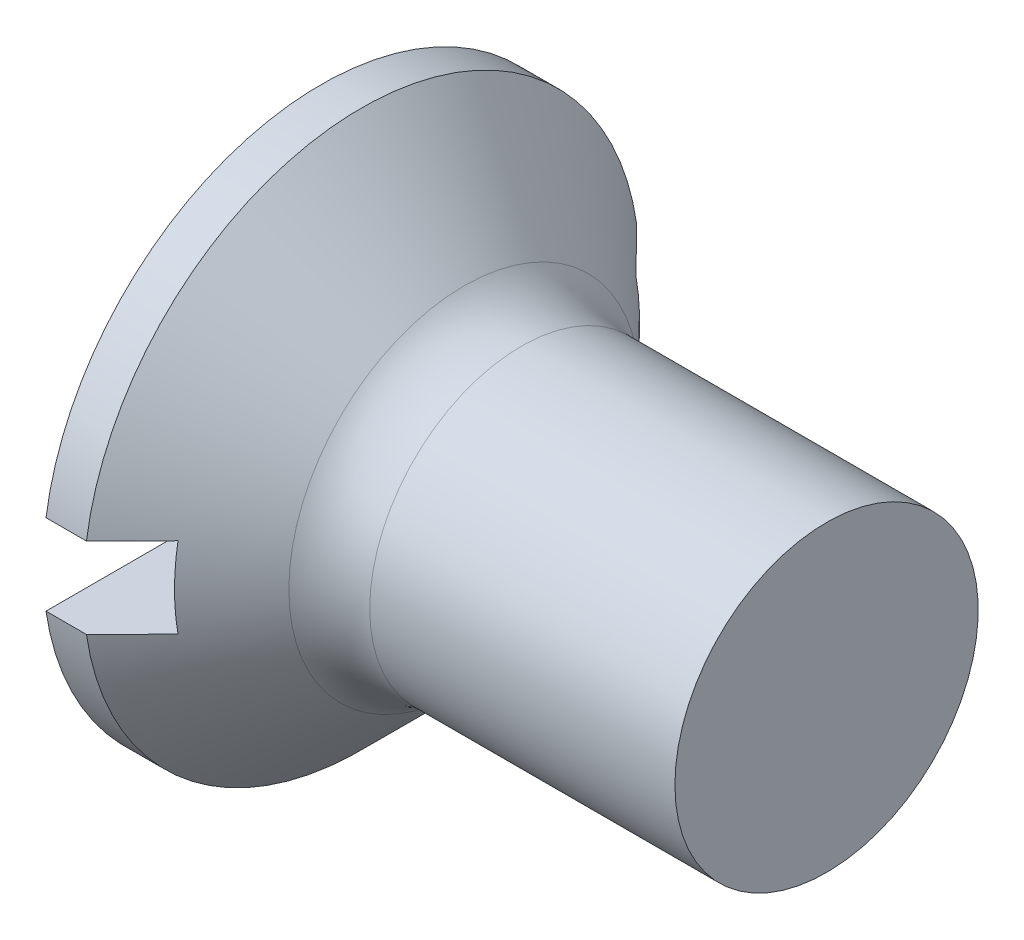
ISO-10303-21;
HEADER;
FILE_DESCRIPTION(('STEP AP214'),'2;1');
FILE_NAME('part.step','',(''),(''),'','','');
FILE_SCHEMA(('AUTOMOTIVE_DESIGN { 1 0 10303 214 1 1 1 1 }'));
ENDSEC;
DATA;
#1=APPLICATION_CONTEXT('core data for automotive mechanical design processes');
#2=APPLICATION_PROTOCOL_DEFINITION('international standard','automotive_design',2000,#1);
#3=PRODUCT_CONTEXT('',#1,'mechanical');
#4=PRODUCT('Part','Part','',(#3));
#5=PRODUCT_RELATED_PRODUCT_CATEGORY('part','',(#4));
#6=PRODUCT_DEFINITION_FORMATION('','',#4);
#7=PRODUCT_DEFINITION_CONTEXT('part definition',#1,'design');
#8=PRODUCT_DEFINITION('design','',#6,#7);
#9=PRODUCT_DEFINITION_SHAPE('','',#8);
#10=(LENGTH_UNIT() NAMED_UNIT(*) SI_UNIT(.MILLI.,.METRE.));
#11=(NAMED_UNIT(*) PLANE_ANGLE_UNIT() SI_UNIT($,.RADIAN.));
#12=(NAMED_UNIT(*) SI_UNIT($,.STERADIAN.) SOLID_ANGLE_UNIT());
#13=UNCERTAINTY_MEASURE_WITH_UNIT(LENGTH_MEASURE(1.E-05),#10,'distance_accuracy_value','');
#14=(GEOMETRIC_REPRESENTATION_CONTEXT(3) GLOBAL_UNCERTAINTY_ASSIGNED_CONTEXT((#13)) GLOBAL_UNIT_ASSIGNED_CONTEXT((#10,
#11,#12)) REPRESENTATION_CONTEXT('',''));
#15=CARTESIAN_POINT('',(0.,0.,0.));
#16=DIRECTION('',(0.,0.,1.));
#17=DIRECTION('',(1.,0.,0.));
#18=AXIS2_PLACEMENT_3D('',#15,#16,#17);
#19=CARTESIAN_POINT('',(0.85,-0.4,-2.75));
#20=DIRECTION('',(1.,0.,0.));
#21=DIRECTION('',(0.,0.,-1.));
#22=AXIS2_PLACEMENT_3D('',#19,#20,#21);
#23=PLANE('',#22);
#24=CARTESIAN_POINT('',(0.850000000014006,0.,0.));
#25=DIRECTION('',(-1.,0.,0.));
#26=DIRECTION('',(0.,0.,1.));
#27=AXIS2_PLACEMENT_3D('',#24,#25,#26);
#28=CIRCLE('',#27,2.30000000001627);
#29=CARTESIAN_POINT('',(0.850000000014577,0.4,2.26495033059717));
#30=VERTEX_POINT('',#29);
#31=CARTESIAN_POINT('',(0.850000000007003,-0.4,2.26495033060486));
#32=VERTEX_POINT('',#31);
#33=EDGE_CURVE('E80',#30,#32,#28,.F.);
#34=ORIENTED_EDGE('',*,*,#33,.F.);
#35=DIRECTION('',(0.,0.,1.));
#36=VECTOR('',#35,1.);
#37=CARTESIAN_POINT('',(0.85,0.4,2.75));
#38=LINE('',#37,#36);
#39=CARTESIAN_POINT('',(0.850000000007003,0.4,-2.26495033060486));
#40=VERTEX_POINT('',#39);
#41=EDGE_CURVE('E82',#30,#40,#38,.F.);
#42=ORIENTED_EDGE('',*,*,#41,.T.);
#43=CARTESIAN_POINT('',(0.850000000014006,0.,0.));
#44=DIRECTION('',(-1.,0.,0.));
#45=DIRECTION('',(0.,0.,1.));
#46=AXIS2_PLACEMENT_3D('',#43,#44,#45);
#47=CIRCLE('',#46,2.30000000001627);
#48=CARTESIAN_POINT('',(0.850000000014577,-0.4,-2.26495033059717));
#49=VERTEX_POINT('',#48);
#50=EDGE_CURVE('E20',#49,#40,#47,.F.);
#51=ORIENTED_EDGE('',*,*,#50,.F.);
#52=DIRECTION('',(0.,0.,-1.));
#53=VECTOR('',#52,1.);
#54=CARTESIAN_POINT('',(0.85,-0.4,-2.75));
#55=LINE('',#54,#53);
#56=EDGE_CURVE('E130',#49,#32,#55,.F.);
#57=ORIENTED_EDGE('',*,*,#56,.T.);
#58=EDGE_LOOP('',(#34,#42,#51,#57));
#59=FACE_BOUND('',#58,.T.);
#60=ADVANCED_FACE('F17',(#59),#23,.F.);
#61=CARTESIAN_POINT('',(0.85,-0.4,-2.75));
#62=DIRECTION('',(0.,-1.,0.));
#63=DIRECTION('',(0.,0.,-1.));
#64=AXIS2_PLACEMENT_3D('',#61,#62,#63);
#65=PLANE('',#64);
#66=CARTESIAN_POINT('',(0.850000000012787,-0.4,2.26495033059899));
#67=CARTESIAN_POINT('',(0.775087851754749,-0.4,2.34100427520643));
#68=CARTESIAN_POINT('',(0.700131776506393,-0.4,2.41701485209761));
#69=CARTESIAN_POINT('',(0.550131776498639,-0.4,2.56894926592026));
#70=CARTESIAN_POINT('',(0.475087851744474,-0.4,2.64487310285688));
#71=CARTESIAN_POINT('',(0.40000000000523,-0.4,2.72075357208242));
#72=B_SPLINE_CURVE_WITH_KNOTS('',3,(#66,#67,#68,#69,#70,#71),.UNSPECIFIED.,.F.,.F.,(4,2,4),(0.,
0.320256442782521,0.640512866479516),.UNSPECIFIED.);
#73=CARTESIAN_POINT('',(0.400000000009254,-0.4,2.72075357208249));
#74=VERTEX_POINT('',#73);
#75=EDGE_CURVE('E120',#32,#74,#72,.T.);
#76=ORIENTED_EDGE('',*,*,#75,.F.);
#77=ORIENTED_EDGE('',*,*,#56,.F.);
#78=CARTESIAN_POINT('',(0.40000000000523,-0.4,-2.72075357208242));
#79=CARTESIAN_POINT('',(0.475087851744869,-0.4,-2.64487310285648));
#80=CARTESIAN_POINT('',(0.550131776499427,-0.4,-2.56894926591946));
#81=CARTESIAN_POINT('',(0.700131776507969,-0.4,-2.41701485209602));
#82=CARTESIAN_POINT('',(0.775087851756716,-0.4,-2.34100427520443));
#83=CARTESIAN_POINT('',(0.850000000015147,-0.4,-2.26495033059659));
#84=B_SPLINE_CURVE_WITH_KNOTS('',3,(#78,#79,#80,#81,#82,#83),.UNSPECIFIED.,.F.,.F.,(4,2,4),(0.,
0.320256423698676,0.640512866482879),.UNSPECIFIED.);
#85=CARTESIAN_POINT('',(0.400000000009186,-0.4,-2.72075357207842));
#86=VERTEX_POINT('',#85);
#87=EDGE_CURVE('E76',#86,#49,#84,.T.);
#88=ORIENTED_EDGE('',*,*,#87,.F.);
#89=DIRECTION('',(1.,0.,0.));
#90=VECTOR('',#89,1.);
#91=CARTESIAN_POINT('',(0.85,-0.4,-2.72075357208256));
#92=LINE('',#91,#90);
#93=CARTESIAN_POINT('',(0.,-0.4,-2.72075357208256));
#94=VERTEX_POINT('',#93);
#95=EDGE_CURVE('E131',#94,#86,#92,.T.);
#96=ORIENTED_EDGE('',*,*,#95,.F.);
#97=DIRECTION('',(0.,0.,1.));
#98=VECTOR('',#97,1.);
#99=CARTESIAN_POINT('',(0.,-0.4,0.));
#100=LINE('',#99,#98);
#101=CARTESIAN_POINT('',(0.,-0.4,2.72075357208256));
#102=VERTEX_POINT('',#101);
#103=EDGE_CURVE('E90',#102,#94,#100,.F.);
#104=ORIENTED_EDGE('',*,*,#103,.F.);
#105=DIRECTION('',(1.,0.,0.));
#106=VECTOR('',#105,1.);
#107=CARTESIAN_POINT('',(0.85,-0.4,2.72075357208256));
#108=LINE('',#107,#106);
#109=EDGE_CURVE('E166',#74,#102,#108,.F.);
#110=ORIENTED_EDGE('',*,*,#109,.F.);
#111=EDGE_LOOP('',(#76,#77,#88,#96,#104,#110));
#112=FACE_BOUND('',#111,.T.);
#113=ADVANCED_FACE('F132',(#112),#65,.F.);
#114=CARTESIAN_POINT('',(0.85,0.4,2.75));
#115=DIRECTION('',(0.,1.,0.));
#116=DIRECTION('',(0.,0.,1.));
#117=AXIS2_PLACEMENT_3D('',#114,#115,#116);
#118=PLANE('',#117);
#119=CARTESIAN_POINT('',(0.850000000012787,0.4,-2.26495033059899));
#120=CARTESIAN_POINT('',(0.775087851754749,0.4,-2.34100427520643));
#121=CARTESIAN_POINT('',(0.700131776506393,0.4,-2.41701485209761));
#122=CARTESIAN_POINT('',(0.550131776498639,0.4,-2.56894926592026));
#123=CARTESIAN_POINT('',(0.475087851744475,0.4,-2.64487310285688));
#124=CARTESIAN_POINT('',(0.40000000000523,0.4,-2.72075357208242));
#125=B_SPLINE_CURVE_WITH_KNOTS('',3,(#119,#120,#121,#122,#123,#124),.UNSPECIFIED.,.F.,.F.,(4,2,
4),(0.,0.320256442782521,0.640512866479515),.UNSPECIFIED.);
#126=CARTESIAN_POINT('',(0.400000000009254,0.4,-2.72075357208249));
#127=VERTEX_POINT('',#126);
#128=EDGE_CURVE('E72',#40,#127,#125,.T.);
#129=ORIENTED_EDGE('',*,*,#128,.F.);
#130=ORIENTED_EDGE('',*,*,#41,.F.);
#131=CARTESIAN_POINT('',(0.40000000000523,0.4,2.72075357208242));
#132=CARTESIAN_POINT('',(0.475087851744869,0.4,2.64487310285648));
#133=CARTESIAN_POINT('',(0.550131776499427,0.4,2.56894926591946));
#134=CARTESIAN_POINT('',(0.700131776507968,0.4,2.41701485209602));
#135=CARTESIAN_POINT('',(0.775087851756716,0.4,2.34100427520443));
#136=CARTESIAN_POINT('',(0.850000000015147,0.4,2.26495033059659));
#137=B_SPLINE_CURVE_WITH_KNOTS('',3,(#131,#132,#133,#134,#135,#136),.UNSPECIFIED.,.F.,.F.,(4,2,
4),(0.,0.320256423698676,0.640512866482879),.UNSPECIFIED.);
#138=CARTESIAN_POINT('',(0.400000000009186,0.4,2.72075357207842));
#139=VERTEX_POINT('',#138);
#140=EDGE_CURVE('E84',#139,#30,#137,.T.);
#141=ORIENTED_EDGE('',*,*,#140,.F.);
#142=DIRECTION('',(1.,0.,0.));
#143=VECTOR('',#142,1.);
#144=CARTESIAN_POINT('',(0.85,0.4,2.72075357208256));
#145=LINE('',#144,#143);
#146=CARTESIAN_POINT('',(0.,0.4,2.72075357208256));
#147=VERTEX_POINT('',#146);
#148=EDGE_CURVE('E35',#147,#139,#145,.T.);
#149=ORIENTED_EDGE('',*,*,#148,.F.);
#150=DIRECTION('',(0.,0.,1.));
#151=VECTOR('',#150,1.);
#152=CARTESIAN_POINT('',(0.,0.4,0.));
#153=LINE('',#152,#151);
#154=CARTESIAN_POINT('',(0.,0.4,-2.72075357208256));
#155=VERTEX_POINT('',#154);
#156=EDGE_CURVE('E161',#155,#147,#153,.T.);
#157=ORIENTED_EDGE('',*,*,#156,.F.);
#158=DIRECTION('',(1.,0.,0.));
#159=VECTOR('',#158,1.);
#160=CARTESIAN_POINT('',(0.85,0.4,-2.72075357208256));
#161=LINE('',#160,#159);
#162=EDGE_CURVE('E88',#127,#155,#161,.F.);
#163=ORIENTED_EDGE('',*,*,#162,.F.);
#164=EDGE_LOOP('',(#129,#130,#141,#149,#157,#163));
#165=FACE_BOUND('',#164,.T.);
#166=ADVANCED_FACE('F87',(#165),#118,.F.);
#167=CARTESIAN_POINT('',(0.,0.,0.));
#168=DIRECTION('',(-1.,0.,0.));
#169=DIRECTION('',(0.,0.,1.));
#170=AXIS2_PLACEMENT_3D('',#167,#168,#169);
#171=PLANE('',#170);
#172=ORIENTED_EDGE('',*,*,#103,.T.);
#173=CARTESIAN_POINT('',(0.,0.,0.));
#174=DIRECTION('',(-1.,0.,0.));
#175=DIRECTION('',(0.,0.,1.));
#176=AXIS2_PLACEMENT_3D('',#173,#174,#175);
#177=CIRCLE('',#176,2.75);
#178=EDGE_CURVE('E100',#102,#94,#177,.F.);
#179=ORIENTED_EDGE('',*,*,#178,.F.);
#180=EDGE_LOOP('',(#172,#179));
#181=FACE_BOUND('',#180,.T.);
#182=ADVANCED_FACE('F142',(#181),#171,.T.);
#183=CARTESIAN_POINT('',(0.,0.,0.));
#184=DIRECTION('',(-1.,0.,0.));
#185=DIRECTION('',(0.,0.,1.));
#186=AXIS2_PLACEMENT_3D('',#183,#184,#185);
#187=PLANE('',#186);
#188=ORIENTED_EDGE('',*,*,#156,.T.);
#189=CARTESIAN_POINT('',(0.,0.,0.));
#190=DIRECTION('',(-1.,0.,0.));
#191=DIRECTION('',(0.,0.,1.));
#192=AXIS2_PLACEMENT_3D('',#189,#190,#191);
#193=CIRCLE('',#192,2.75);
#194=EDGE_CURVE('E172',#155,#147,#193,.F.);
#195=ORIENTED_EDGE('',*,*,#194,.F.);
#196=EDGE_LOOP('',(#188,#195));
#197=FACE_BOUND('',#196,.T.);
#198=ADVANCED_FACE('F187',(#197),#187,.T.);
#199=CARTESIAN_POINT('',(-6.34999999999999,0.,0.));
#200=DIRECTION('',(-1.,0.,0.));
#201=DIRECTION('',(0.,0.,1.));
#202=AXIS2_PLACEMENT_3D('',#199,#200,#201);
#203=CYLINDRICAL_SURFACE('',#202,2.75);
#204=ORIENTED_EDGE('',*,*,#95,.T.);
#205=CARTESIAN_POINT('',(0.400000000013279,0.,0.));
#206=DIRECTION('',(-1.,0.,0.));
#207=DIRECTION('',(0.,0.,1.));
#208=AXIS2_PLACEMENT_3D('',#205,#206,#207);
#209=CIRCLE('',#208,2.74999999999181);
#210=EDGE_CURVE('E169',#74,#86,#209,.F.);
#211=ORIENTED_EDGE('',*,*,#210,.F.);
#212=ORIENTED_EDGE('',*,*,#109,.T.);
#213=ORIENTED_EDGE('',*,*,#178,.T.);
#214=EDGE_LOOP('',(#204,#211,#212,#213));
#215=FACE_BOUND('',#214,.T.);
#216=ADVANCED_FACE('F181',(#215),#203,.T.);
#217=CARTESIAN_POINT('',(-6.34999999999999,0.,0.));
#218=DIRECTION('',(-1.,0.,0.));
#219=DIRECTION('',(0.,0.,1.));
#220=AXIS2_PLACEMENT_3D('',#217,#218,#219);
#221=CYLINDRICAL_SURFACE('',#220,2.75);
#222=ORIENTED_EDGE('',*,*,#148,.T.);
#223=CARTESIAN_POINT('',(0.400000000013279,0.,0.));
#224=DIRECTION('',(-1.,0.,0.));
#225=DIRECTION('',(0.,0.,1.));
#226=AXIS2_PLACEMENT_3D('',#223,#224,#225);
#227=CIRCLE('',#226,2.74999999999181);
#228=EDGE_CURVE('E160',#127,#139,#227,.F.);
#229=ORIENTED_EDGE('',*,*,#228,.F.);
#230=ORIENTED_EDGE('',*,*,#162,.T.);
#231=ORIENTED_EDGE('',*,*,#194,.T.);
#232=EDGE_LOOP('',(#222,#229,#230,#231));
#233=FACE_BOUND('',#232,.T.);
#234=ADVANCED_FACE('F114',(#233),#221,.T.);
#235=CARTESIAN_POINT('',(0.400000000013279,0.,0.));
#236=DIRECTION('',(-1.,0.,0.));
#237=DIRECTION('',(0.,0.,1.));
#238=AXIS2_PLACEMENT_3D('',#235,#236,#237);
#239=CONICAL_SURFACE('',#238,2.74999999999181,0.785398163369466);
#240=ORIENTED_EDGE('',*,*,#87,.T.);
#241=ORIENTED_EDGE('',*,*,#50,.T.);
#242=ORIENTED_EDGE('',*,*,#128,.T.);
#243=ORIENTED_EDGE('',*,*,#228,.T.);
#244=ORIENTED_EDGE('',*,*,#140,.T.);
#245=ORIENTED_EDGE('',*,*,#33,.T.);
#246=ORIENTED_EDGE('',*,*,#75,.T.);
#247=ORIENTED_EDGE('',*,*,#210,.T.);
#248=EDGE_LOOP('',(#240,#241,#242,#243,#244,#245,#246,#247));
#249=FACE_BOUND('',#248,.T.);
#250=CARTESIAN_POINT('',(1.41568542494924,0.,0.));
#251=DIRECTION('',(-1.,0.,0.));
#252=DIRECTION('',(0.,0.,1.));
#253=AXIS2_PLACEMENT_3D('',#250,#251,#252);
#254=CIRCLE('',#253,1.73431457505076);
#255=CARTESIAN_POINT('',(1.41568542494924,0.,1.73431457505076));
#256=VERTEX_POINT('',#255);
#257=EDGE_CURVE('E157',#256,#256,#254,.T.);
#258=ORIENTED_EDGE('',*,*,#257,.T.);
#259=EDGE_LOOP('',(#258));
#260=FACE_BOUND('',#259,.T.);
#261=ADVANCED_FACE('F68',(#249,#260),#239,.T.);
#262=CARTESIAN_POINT('',(5.,1.5,0.));
#263=DIRECTION('',(1.,0.,0.));
#264=DIRECTION('',(0.,0.,-1.));
#265=AXIS2_PLACEMENT_3D('',#262,#263,#264);
#266=PLANE('',#265);
#267=CARTESIAN_POINT('',(5.,0.,0.));
#268=DIRECTION('',(-1.,0.,0.));
#269=DIRECTION('',(0.,0.,1.));
#270=AXIS2_PLACEMENT_3D('',#267,#268,#269);
#271=CIRCLE('',#270,1.5);
#272=CARTESIAN_POINT('',(5.,0.,1.5));
#273=VERTEX_POINT('',#272);
#274=EDGE_CURVE('E26',#273,#273,#271,.T.);
#275=ORIENTED_EDGE('',*,*,#274,.F.);
#276=EDGE_LOOP('',(#275));
#277=FACE_BOUND('',#276,.T.);
#278=ADVANCED_FACE('F113',(#277),#266,.T.);
#279=CARTESIAN_POINT('',(1.98137084989848,0.,0.));
#280=DIRECTION('',(-1.,0.,0.));
#281=DIRECTION('',(0.,0.,1.));
#282=AXIS2_PLACEMENT_3D('',#279,#280,#281);
#283=TOROIDAL_SURFACE('',#282,2.3,0.8);
#284=ORIENTED_EDGE('',*,*,#257,.F.);
#285=EDGE_LOOP('',(#284));
#286=FACE_BOUND('',#285,.T.);
#287=CARTESIAN_POINT('',(1.98137084989848,0.,0.));
#288=DIRECTION('',(-1.,0.,0.));
#289=DIRECTION('',(0.,0.,1.));
#290=AXIS2_PLACEMENT_3D('',#287,#288,#289);
#291=CIRCLE('',#290,1.5);
#292=CARTESIAN_POINT('',(1.98137084989848,0.,1.5));
#293=VERTEX_POINT('',#292);
#294=EDGE_CURVE('E11',#293,#293,#291,.F.);
#295=ORIENTED_EDGE('',*,*,#294,.F.);
#296=EDGE_LOOP('',(#295));
#297=FACE_BOUND('',#296,.T.);
#298=ADVANCED_FACE('F146',(#286,#297),#283,.F.);
#299=CARTESIAN_POINT('',(-6.34999999999999,0.,0.));
#300=DIRECTION('',(-1.,0.,0.));
#301=DIRECTION('',(0.,0.,1.));
#302=AXIS2_PLACEMENT_3D('',#299,#300,#301);
#303=CYLINDRICAL_SURFACE('',#302,1.5);
#304=ORIENTED_EDGE('',*,*,#294,.T.);
#305=EDGE_LOOP('',(#304));
#306=FACE_BOUND('',#305,.T.);
#307=ORIENTED_EDGE('',*,*,#274,.T.);
#308=EDGE_LOOP('',(#307));
#309=FACE_BOUND('',#308,.T.);
#310=ADVANCED_FACE('F144',(#306,#309),#303,.T.);
#311=CLOSED_SHELL('',(#60,#113,#166,#182,#198,#216,#234,#261,#278,#298,#310));
#312=MANIFOLD_SOLID_BREP('B1',#311);
#313=ADVANCED_BREP_SHAPE_REPRESENTATION('',(#18,#312),#14);
#314=SHAPE_DEFINITION_REPRESENTATION(#9,#313);
ENDSEC;
END-ISO-10303-21;
